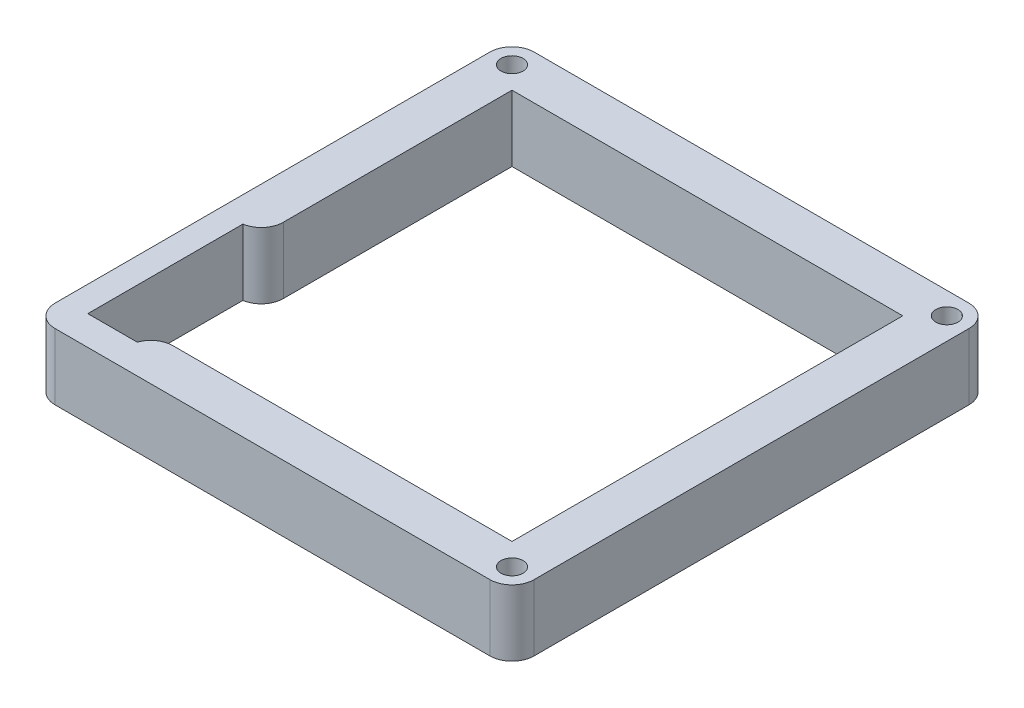
ISO-10303-21;
HEADER;
FILE_DESCRIPTION(('STEP AP214'),'2;1');
FILE_NAME('part.step','',(''),(''),'','','');
FILE_SCHEMA(('AUTOMOTIVE_DESIGN { 1 0 10303 214 1 1 1 1 }'));
ENDSEC;
DATA;
#1=APPLICATION_CONTEXT('core data for automotive mechanical design processes');
#2=APPLICATION_PROTOCOL_DEFINITION('international standard','automotive_design',2000,#1);
#3=PRODUCT_CONTEXT('',#1,'mechanical');
#4=PRODUCT('Part','Part','',(#3));
#5=PRODUCT_RELATED_PRODUCT_CATEGORY('part','',(#4));
#6=PRODUCT_DEFINITION_FORMATION('','',#4);
#7=PRODUCT_DEFINITION_CONTEXT('part definition',#1,'design');
#8=PRODUCT_DEFINITION('design','',#6,#7);
#9=PRODUCT_DEFINITION_SHAPE('','',#8);
#10=(LENGTH_UNIT() NAMED_UNIT(*) SI_UNIT(.MILLI.,.METRE.));
#11=(NAMED_UNIT(*) PLANE_ANGLE_UNIT() SI_UNIT($,.RADIAN.));
#12=(NAMED_UNIT(*) SI_UNIT($,.STERADIAN.) SOLID_ANGLE_UNIT());
#13=UNCERTAINTY_MEASURE_WITH_UNIT(LENGTH_MEASURE(1.E-05),#10,'distance_accuracy_value','');
#14=(GEOMETRIC_REPRESENTATION_CONTEXT(3) GLOBAL_UNCERTAINTY_ASSIGNED_CONTEXT((#13)) GLOBAL_UNIT_ASSIGNED_CONTEXT((#10,
#11,#12)) REPRESENTATION_CONTEXT('',''));
#15=CARTESIAN_POINT('',(0.,0.,0.));
#16=DIRECTION('',(0.,0.,1.));
#17=DIRECTION('',(1.,0.,0.));
#18=AXIS2_PLACEMENT_3D('',#15,#16,#17);
#19=CARTESIAN_POINT('',(0.,19.05,-56.2805835913248));
#20=DIRECTION('',(0.,0.,-1.));
#21=DIRECTION('',(-1.,0.,0.));
#22=AXIS2_PLACEMENT_3D('',#19,#20,#21);
#23=PLANE('',#22);
#24=DIRECTION('',(1.,0.,0.));
#25=VECTOR('',#24,1.);
#26=CARTESIAN_POINT('',(0.,0.,-56.2805835913248));
#27=LINE('',#26,#25);
#28=CARTESIAN_POINT('',(-56.2805835913248,0.,-56.2805835913248));
#29=VERTEX_POINT('',#28);
#30=CARTESIAN_POINT('',(56.2805835913248,0.,-56.2805835913248));
#31=VERTEX_POINT('',#30);
#32=EDGE_CURVE('E171',#29,#31,#27,.T.);
#33=ORIENTED_EDGE('',*,*,#32,.T.);
#34=DIRECTION('',(0.,-1.,0.));
#35=VECTOR('',#34,1.);
#36=CARTESIAN_POINT('',(56.2805835913248,19.05,-56.2805835913248));
#37=LINE('',#36,#35);
#38=CARTESIAN_POINT('',(56.2805835913248,19.05,-56.2805835913248));
#39=VERTEX_POINT('',#38);
#40=EDGE_CURVE('E153',#39,#31,#37,.T.);
#41=ORIENTED_EDGE('',*,*,#40,.F.);
#42=DIRECTION('',(1.,0.,0.));
#43=VECTOR('',#42,1.);
#44=CARTESIAN_POINT('',(0.,19.05,-56.2805835913248));
#45=LINE('',#44,#43);
#46=CARTESIAN_POINT('',(-56.2805835913248,19.05,-56.2805835913248));
#47=VERTEX_POINT('',#46);
#48=EDGE_CURVE('E159',#47,#39,#45,.T.);
#49=ORIENTED_EDGE('',*,*,#48,.F.);
#50=DIRECTION('',(0.,-1.,0.));
#51=VECTOR('',#50,1.);
#52=CARTESIAN_POINT('',(-56.2805835913248,19.05,-56.2805835913248));
#53=LINE('',#52,#51);
#54=EDGE_CURVE('E231',#47,#29,#53,.T.);
#55=ORIENTED_EDGE('',*,*,#54,.T.);
#56=EDGE_LOOP('',(#33,#41,#49,#55));
#57=FACE_BOUND('',#56,.T.);
#58=ADVANCED_FACE('F36',(#57),#23,.F.);
#59=CARTESIAN_POINT('',(56.2805835913248,19.05,0.));
#60=DIRECTION('',(1.,0.,0.));
#61=DIRECTION('',(0.,0.,-1.));
#62=AXIS2_PLACEMENT_3D('',#59,#60,#61);
#63=PLANE('',#62);
#64=DIRECTION('',(0.,0.,1.));
#65=VECTOR('',#64,1.);
#66=CARTESIAN_POINT('',(56.2805835913248,0.,0.));
#67=LINE('',#66,#65);
#68=CARTESIAN_POINT('',(56.2805835913248,0.,56.2805835913248));
#69=VERTEX_POINT('',#68);
#70=EDGE_CURVE('E288',#31,#69,#67,.T.);
#71=ORIENTED_EDGE('',*,*,#70,.T.);
#72=DIRECTION('',(0.,-1.,0.));
#73=VECTOR('',#72,1.);
#74=CARTESIAN_POINT('',(56.2805835913248,19.05,56.2805835913248));
#75=LINE('',#74,#73);
#76=CARTESIAN_POINT('',(56.2805835913248,19.05,56.2805835913248));
#77=VERTEX_POINT('',#76);
#78=EDGE_CURVE('E156',#77,#69,#75,.T.);
#79=ORIENTED_EDGE('',*,*,#78,.F.);
#80=DIRECTION('',(0.,0.,1.));
#81=VECTOR('',#80,1.);
#82=CARTESIAN_POINT('',(56.2805835913248,19.05,0.));
#83=LINE('',#82,#81);
#84=EDGE_CURVE('E148',#39,#77,#83,.T.);
#85=ORIENTED_EDGE('',*,*,#84,.F.);
#86=ORIENTED_EDGE('',*,*,#40,.T.);
#87=EDGE_LOOP('',(#71,#79,#85,#86));
#88=FACE_BOUND('',#87,.T.);
#89=ADVANCED_FACE('F151',(#88),#63,.F.);
#90=CARTESIAN_POINT('',(0.,19.05,56.2805835913248));
#91=DIRECTION('',(0.,0.,-1.));
#92=DIRECTION('',(-1.,0.,0.));
#93=AXIS2_PLACEMENT_3D('',#90,#91,#92);
#94=PLANE('',#93);
#95=DIRECTION('',(1.,0.,0.));
#96=VECTOR('',#95,1.);
#97=CARTESIAN_POINT('',(0.,0.,56.2805835913248));
#98=LINE('',#97,#96);
#99=CARTESIAN_POINT('',(-41.3896001921416,0.,56.2805835913248));
#100=VERTEX_POINT('',#99);
#101=EDGE_CURVE('E248',#100,#69,#98,.T.);
#102=ORIENTED_EDGE('',*,*,#101,.F.);
#103=DIRECTION('',(0.,-1.,0.));
#104=VECTOR('',#103,1.);
#105=CARTESIAN_POINT('',(-41.3896001921416,19.05,56.2805835913248));
#106=LINE('',#105,#104);
#107=CARTESIAN_POINT('',(-41.3896001921416,19.05,56.2805835913248));
#108=VERTEX_POINT('',#107);
#109=EDGE_CURVE('E11',#100,#108,#106,.F.);
#110=ORIENTED_EDGE('',*,*,#109,.T.);
#111=DIRECTION('',(1.,0.,0.));
#112=VECTOR('',#111,1.);
#113=CARTESIAN_POINT('',(0.,19.05,56.2805835913248));
#114=LINE('',#113,#112);
#115=EDGE_CURVE('E158',#108,#77,#114,.T.);
#116=ORIENTED_EDGE('',*,*,#115,.T.);
#117=ORIENTED_EDGE('',*,*,#78,.T.);
#118=EDGE_LOOP('',(#102,#110,#116,#117));
#119=FACE_BOUND('',#118,.T.);
#120=ADVANCED_FACE('F289',(#119),#94,.T.);
#121=CARTESIAN_POINT('',(0.,19.05,60.5459793493046));
#122=DIRECTION('',(0.,0.,-1.));
#123=DIRECTION('',(-1.,0.,0.));
#124=AXIS2_PLACEMENT_3D('',#121,#122,#123);
#125=PLANE('',#124);
#126=DIRECTION('',(1.,0.,0.));
#127=VECTOR('',#126,1.);
#128=CARTESIAN_POINT('',(0.,0.,60.5459793493046));
#129=LINE('',#128,#127);
#130=CARTESIAN_POINT('',(-61.6370769800922,0.,60.5459793493046));
#131=VERTEX_POINT('',#130);
#132=CARTESIAN_POINT('',(-47.3876769800922,0.,60.5459793493046));
#133=VERTEX_POINT('',#132);
#134=EDGE_CURVE('E244',#131,#133,#129,.T.);
#135=ORIENTED_EDGE('',*,*,#134,.F.);
#136=DIRECTION('',(0.,-1.,0.));
#137=VECTOR('',#136,1.);
#138=CARTESIAN_POINT('',(-61.6370769800922,19.05,60.5459793493046));
#139=LINE('',#138,#137);
#140=CARTESIAN_POINT('',(-61.6370769800922,19.05,60.5459793493046));
#141=VERTEX_POINT('',#140);
#142=EDGE_CURVE('E242',#141,#131,#139,.T.);
#143=ORIENTED_EDGE('',*,*,#142,.F.);
#144=DIRECTION('',(1.,0.,0.));
#145=VECTOR('',#144,1.);
#146=CARTESIAN_POINT('',(0.,19.05,60.5459793493046));
#147=LINE('',#146,#145);
#148=CARTESIAN_POINT('',(-47.3876769800922,19.05,60.5459793493046));
#149=VERTEX_POINT('',#148);
#150=EDGE_CURVE('E259',#141,#149,#147,.T.);
#151=ORIENTED_EDGE('',*,*,#150,.T.);
#152=DIRECTION('',(0.,-1.,0.));
#153=VECTOR('',#152,1.);
#154=CARTESIAN_POINT('',(-47.3876769800922,19.05,60.5459793493046));
#155=LINE('',#154,#153);
#156=EDGE_CURVE('E176',#149,#133,#155,.T.);
#157=ORIENTED_EDGE('',*,*,#156,.T.);
#158=EDGE_LOOP('',(#135,#143,#151,#157));
#159=FACE_BOUND('',#158,.T.);
#160=ADVANCED_FACE('F258',(#159),#125,.T.);
#161=CARTESIAN_POINT('',(-61.6370769800922,19.05,0.));
#162=DIRECTION('',(1.,0.,0.));
#163=DIRECTION('',(0.,0.,-1.));
#164=AXIS2_PLACEMENT_3D('',#161,#162,#163);
#165=PLANE('',#164);
#166=DIRECTION('',(0.,0.,1.));
#167=VECTOR('',#166,1.);
#168=CARTESIAN_POINT('',(-61.6370769800922,0.,0.));
#169=LINE('',#168,#167);
#170=CARTESIAN_POINT('',(-61.6370769800922,0.,15.8745968517571));
#171=VERTEX_POINT('',#170);
#172=EDGE_CURVE('E238',#171,#131,#169,.T.);
#173=ORIENTED_EDGE('',*,*,#172,.F.);
#174=DIRECTION('',(0.,-1.,0.));
#175=VECTOR('',#174,1.);
#176=CARTESIAN_POINT('',(-61.6370769800922,19.05,15.8745968517571));
#177=LINE('',#176,#175);
#178=CARTESIAN_POINT('',(-61.6370769800922,19.05,15.8745968517571));
#179=VERTEX_POINT('',#178);
#180=EDGE_CURVE('E234',#179,#171,#177,.T.);
#181=ORIENTED_EDGE('',*,*,#180,.F.);
#182=DIRECTION('',(0.,0.,1.));
#183=VECTOR('',#182,1.);
#184=CARTESIAN_POINT('',(-61.6370769800922,19.05,0.));
#185=LINE('',#184,#183);
#186=EDGE_CURVE('E223',#179,#141,#185,.T.);
#187=ORIENTED_EDGE('',*,*,#186,.T.);
#188=ORIENTED_EDGE('',*,*,#142,.T.);
#189=EDGE_LOOP('',(#173,#181,#187,#188));
#190=FACE_BOUND('',#189,.T.);
#191=ADVANCED_FACE('F241',(#190),#165,.T.);
#192=CARTESIAN_POINT('',(0.,19.05,-68.9805835913248));
#193=DIRECTION('',(0.,0.,1.));
#194=DIRECTION('',(1.,0.,0.));
#195=AXIS2_PLACEMENT_3D('',#192,#193,#194);
#196=PLANE('',#195);
#197=DIRECTION('',(-1.,0.,0.));
#198=VECTOR('',#197,1.);
#199=CARTESIAN_POINT('',(0.,19.05,-68.9805835913248));
#200=LINE('',#199,#198);
#201=CARTESIAN_POINT('',(62.6305835913248,19.05,-68.9805835913248));
#202=VERTEX_POINT('',#201);
#203=CARTESIAN_POINT('',(-62.6305835913248,19.05,-68.9805835913248));
#204=VERTEX_POINT('',#203);
#205=EDGE_CURVE('E505',#202,#204,#200,.T.);
#206=ORIENTED_EDGE('',*,*,#205,.F.);
#207=DIRECTION('',(0.,-1.,0.));
#208=VECTOR('',#207,1.);
#209=CARTESIAN_POINT('',(62.6305835913248,0.,-68.9805835913248));
#210=LINE('',#209,#208);
#211=CARTESIAN_POINT('',(62.6305835913248,0.,-68.9805835913248));
#212=VERTEX_POINT('',#211);
#213=EDGE_CURVE('E174',#202,#212,#210,.T.);
#214=ORIENTED_EDGE('',*,*,#213,.T.);
#215=DIRECTION('',(-1.,0.,0.));
#216=VECTOR('',#215,1.);
#217=CARTESIAN_POINT('',(0.,0.,-68.9805835913248));
#218=LINE('',#217,#216);
#219=CARTESIAN_POINT('',(-62.6305835913248,0.,-68.9805835913248));
#220=VERTEX_POINT('',#219);
#221=EDGE_CURVE('E275',#212,#220,#218,.T.);
#222=ORIENTED_EDGE('',*,*,#221,.T.);
#223=DIRECTION('',(0.,-1.,0.));
#224=VECTOR('',#223,1.);
#225=CARTESIAN_POINT('',(-62.6305835913248,19.05,-68.9805835913248));
#226=LINE('',#225,#224);
#227=EDGE_CURVE('E172',#220,#204,#226,.F.);
#228=ORIENTED_EDGE('',*,*,#227,.T.);
#229=EDGE_LOOP('',(#206,#214,#222,#228));
#230=FACE_BOUND('',#229,.T.);
#231=ADVANCED_FACE('F315',(#230),#196,.F.);
#232=CARTESIAN_POINT('',(-68.9805835913248,19.05,0.));
#233=DIRECTION('',(1.,0.,0.));
#234=DIRECTION('',(0.,0.,-1.));
#235=AXIS2_PLACEMENT_3D('',#232,#233,#234);
#236=PLANE('',#235);
#237=DIRECTION('',(0.,0.,1.));
#238=VECTOR('',#237,1.);
#239=CARTESIAN_POINT('',(-68.9805835913248,0.,0.));
#240=LINE('',#239,#238);
#241=CARTESIAN_POINT('',(-68.9805835913248,0.,-62.6305835913248));
#242=VERTEX_POINT('',#241);
#243=CARTESIAN_POINT('',(-68.9805835913248,0.,62.6305835913248));
#244=VERTEX_POINT('',#243);
#245=EDGE_CURVE('E278',#242,#244,#240,.T.);
#246=ORIENTED_EDGE('',*,*,#245,.T.);
#247=DIRECTION('',(0.,-1.,0.));
#248=VECTOR('',#247,1.);
#249=CARTESIAN_POINT('',(-68.9805835913248,19.05,62.6305835913248));
#250=LINE('',#249,#248);
#251=CARTESIAN_POINT('',(-68.9805835913248,19.05,62.6305835913248));
#252=VERTEX_POINT('',#251);
#253=EDGE_CURVE('E211',#244,#252,#250,.F.);
#254=ORIENTED_EDGE('',*,*,#253,.T.);
#255=DIRECTION('',(0.,0.,1.));
#256=VECTOR('',#255,1.);
#257=CARTESIAN_POINT('',(-68.9805835913248,19.05,0.));
#258=LINE('',#257,#256);
#259=CARTESIAN_POINT('',(-68.9805835913248,19.05,-62.6305835913248));
#260=VERTEX_POINT('',#259);
#261=EDGE_CURVE('E514',#260,#252,#258,.T.);
#262=ORIENTED_EDGE('',*,*,#261,.F.);
#263=DIRECTION('',(0.,-1.,0.));
#264=VECTOR('',#263,1.);
#265=CARTESIAN_POINT('',(-68.9805835913248,19.05,-62.6305835913248));
#266=LINE('',#265,#264);
#267=EDGE_CURVE('E208',#260,#242,#266,.T.);
#268=ORIENTED_EDGE('',*,*,#267,.T.);
#269=EDGE_LOOP('',(#246,#254,#262,#268));
#270=FACE_BOUND('',#269,.T.);
#271=ADVANCED_FACE('F311',(#270),#236,.F.);
#272=CARTESIAN_POINT('',(0.,19.05,68.9805835913248));
#273=DIRECTION('',(0.,0.,1.));
#274=DIRECTION('',(1.,0.,0.));
#275=AXIS2_PLACEMENT_3D('',#272,#273,#274);
#276=PLANE('',#275);
#277=DIRECTION('',(-1.,0.,0.));
#278=VECTOR('',#277,1.);
#279=CARTESIAN_POINT('',(0.,0.,68.9805835913248));
#280=LINE('',#279,#278);
#281=CARTESIAN_POINT('',(62.6305835913248,0.,68.9805835913248));
#282=VERTEX_POINT('',#281);
#283=CARTESIAN_POINT('',(-62.6305835913248,0.,68.9805835913248));
#284=VERTEX_POINT('',#283);
#285=EDGE_CURVE('E281',#282,#284,#280,.T.);
#286=ORIENTED_EDGE('',*,*,#285,.F.);
#287=DIRECTION('',(0.,-1.,0.));
#288=VECTOR('',#287,1.);
#289=CARTESIAN_POINT('',(62.6305835913248,19.05,68.9805835913248));
#290=LINE('',#289,#288);
#291=CARTESIAN_POINT('',(62.6305835913248,19.05,68.9805835913248));
#292=VERTEX_POINT('',#291);
#293=EDGE_CURVE('E206',#282,#292,#290,.F.);
#294=ORIENTED_EDGE('',*,*,#293,.T.);
#295=DIRECTION('',(-1.,0.,0.));
#296=VECTOR('',#295,1.);
#297=CARTESIAN_POINT('',(0.,19.05,68.9805835913248));
#298=LINE('',#297,#296);
#299=CARTESIAN_POINT('',(-62.6305835913248,19.05,68.9805835913248));
#300=VERTEX_POINT('',#299);
#301=EDGE_CURVE('E499',#292,#300,#298,.T.);
#302=ORIENTED_EDGE('',*,*,#301,.T.);
#303=DIRECTION('',(0.,-1.,0.));
#304=VECTOR('',#303,1.);
#305=CARTESIAN_POINT('',(-62.6305835913248,0.,68.9805835913248));
#306=LINE('',#305,#304);
#307=EDGE_CURVE('E203',#300,#284,#306,.T.);
#308=ORIENTED_EDGE('',*,*,#307,.T.);
#309=EDGE_LOOP('',(#286,#294,#302,#308));
#310=FACE_BOUND('',#309,.T.);
#311=ADVANCED_FACE('F307',(#310),#276,.T.);
#312=CARTESIAN_POINT('',(68.9805835913248,19.05,0.));
#313=DIRECTION('',(1.,0.,0.));
#314=DIRECTION('',(0.,0.,-1.));
#315=AXIS2_PLACEMENT_3D('',#312,#313,#314);
#316=PLANE('',#315);
#317=DIRECTION('',(0.,0.,1.));
#318=VECTOR('',#317,1.);
#319=CARTESIAN_POINT('',(68.9805835913248,0.,0.));
#320=LINE('',#319,#318);
#321=CARTESIAN_POINT('',(68.9805835913248,0.,-62.6305835913248));
#322=VERTEX_POINT('',#321);
#323=CARTESIAN_POINT('',(68.9805835913248,0.,62.6305835913248));
#324=VERTEX_POINT('',#323);
#325=EDGE_CURVE('E284',#322,#324,#320,.T.);
#326=ORIENTED_EDGE('',*,*,#325,.F.);
#327=DIRECTION('',(0.,-1.,0.));
#328=VECTOR('',#327,1.);
#329=CARTESIAN_POINT('',(68.9805835913248,19.05,-62.6305835913248));
#330=LINE('',#329,#328);
#331=CARTESIAN_POINT('',(68.9805835913248,19.05,-62.6305835913248));
#332=VERTEX_POINT('',#331);
#333=EDGE_CURVE('E193',#322,#332,#330,.F.);
#334=ORIENTED_EDGE('',*,*,#333,.T.);
#335=DIRECTION('',(0.,0.,1.));
#336=VECTOR('',#335,1.);
#337=CARTESIAN_POINT('',(68.9805835913248,19.05,0.));
#338=LINE('',#337,#336);
#339=CARTESIAN_POINT('',(68.9805835913248,19.05,62.6305835913248));
#340=VERTEX_POINT('',#339);
#341=EDGE_CURVE('E168',#332,#340,#338,.T.);
#342=ORIENTED_EDGE('',*,*,#341,.T.);
#343=DIRECTION('',(0.,-1.,0.));
#344=VECTOR('',#343,1.);
#345=CARTESIAN_POINT('',(68.9805835913248,19.05,62.6305835913248));
#346=LINE('',#345,#344);
#347=EDGE_CURVE('E190',#340,#324,#346,.T.);
#348=ORIENTED_EDGE('',*,*,#347,.T.);
#349=EDGE_LOOP('',(#326,#334,#342,#348));
#350=FACE_BOUND('',#349,.T.);
#351=ADVANCED_FACE('F303',(#350),#316,.T.);
#352=CARTESIAN_POINT('',(62.630583591325,19.05,62.630583591325));
#353=DIRECTION('',(0.,-1.,0.));
#354=DIRECTION('',(0.,0.,-1.));
#355=AXIS2_PLACEMENT_3D('',#352,#353,#354);
#356=CYLINDRICAL_SURFACE('',#355,3.175);
#357=CARTESIAN_POINT('',(62.630583591325,19.05,62.630583591325));
#358=DIRECTION('',(0.,1.,0.));
#359=DIRECTION('',(0.,0.,1.));
#360=AXIS2_PLACEMENT_3D('',#357,#358,#359);
#361=CIRCLE('',#360,3.175);
#362=CARTESIAN_POINT('',(62.630583591325,19.05,59.455583591325));
#363=VERTEX_POINT('',#362);
#364=EDGE_CURVE('E490',#363,#363,#361,.T.);
#365=CARTESIAN_POINT('',(62.630583591325,0.,62.630583591325));
#366=DIRECTION('',(0.,1.,0.));
#367=DIRECTION('',(0.,0.,1.));
#368=AXIS2_PLACEMENT_3D('',#365,#366,#367);
#369=CIRCLE('',#368,3.175);
#370=CARTESIAN_POINT('',(62.630583591325,0.,59.455583591325));
#371=VERTEX_POINT('',#370);
#372=EDGE_CURVE('E272',#371,#371,#369,.T.);
#373=CARTESIAN_POINT('',(62.630583591325,19.05,59.455583591325));
#374=CARTESIAN_POINT('',(62.630583591325,18.8515625,59.455583591325));
#375=CARTESIAN_POINT('',(62.630583591325,18.653125,59.455583591325));
#376=CARTESIAN_POINT('',(62.630583591325,18.25625,59.455583591325));
#377=CARTESIAN_POINT('',(62.630583591325,18.0578125,59.455583591325));
#378=CARTESIAN_POINT('',(62.630583591325,17.6609375,59.455583591325));
#379=CARTESIAN_POINT('',(62.630583591325,17.4625,59.455583591325));
#380=CARTESIAN_POINT('',(62.630583591325,17.065625,59.455583591325));
#381=CARTESIAN_POINT('',(62.630583591325,16.8671875,59.455583591325));
#382=CARTESIAN_POINT('',(62.630583591325,16.4703125,59.455583591325));
#383=CARTESIAN_POINT('',(62.630583591325,16.271875,59.455583591325));
#384=CARTESIAN_POINT('',(62.630583591325,15.875,59.455583591325));
#385=CARTESIAN_POINT('',(62.630583591325,15.6765625,59.455583591325));
#386=CARTESIAN_POINT('',(62.630583591325,15.2796875,59.455583591325));
#387=CARTESIAN_POINT('',(62.630583591325,15.08125,59.455583591325));
#388=CARTESIAN_POINT('',(62.630583591325,14.684375,59.455583591325));
#389=CARTESIAN_POINT('',(62.630583591325,14.4859375,59.455583591325));
#390=CARTESIAN_POINT('',(62.630583591325,14.0890625,59.455583591325));
#391=CARTESIAN_POINT('',(62.630583591325,13.890625,59.455583591325));
#392=CARTESIAN_POINT('',(62.630583591325,13.49375,59.455583591325));
#393=CARTESIAN_POINT('',(62.630583591325,13.2953125,59.455583591325));
#394=CARTESIAN_POINT('',(62.630583591325,12.8984375,59.455583591325));
#395=CARTESIAN_POINT('',(62.630583591325,12.7,59.455583591325));
#396=CARTESIAN_POINT('',(62.630583591325,12.303125,59.455583591325));
#397=CARTESIAN_POINT('',(62.630583591325,12.1046875,59.455583591325));
#398=CARTESIAN_POINT('',(62.630583591325,11.7078125,59.455583591325));
#399=CARTESIAN_POINT('',(62.630583591325,11.509375,59.455583591325));
#400=CARTESIAN_POINT('',(62.630583591325,11.1125,59.455583591325));
#401=CARTESIAN_POINT('',(62.630583591325,10.9140625,59.455583591325));
#402=CARTESIAN_POINT('',(62.630583591325,10.5171875,59.455583591325));
#403=CARTESIAN_POINT('',(62.630583591325,10.31875,59.455583591325));
#404=CARTESIAN_POINT('',(62.630583591325,9.921875,59.455583591325));
#405=CARTESIAN_POINT('',(62.630583591325,9.7234375,59.455583591325));
#406=CARTESIAN_POINT('',(62.630583591325,9.3265625,59.455583591325));
#407=CARTESIAN_POINT('',(62.630583591325,9.128125,59.455583591325));
#408=CARTESIAN_POINT('',(62.630583591325,8.73125,59.455583591325));
#409=CARTESIAN_POINT('',(62.630583591325,8.5328125,59.455583591325));
#410=CARTESIAN_POINT('',(62.630583591325,8.1359375,59.455583591325));
#411=CARTESIAN_POINT('',(62.630583591325,7.9375,59.455583591325));
#412=CARTESIAN_POINT('',(62.630583591325,7.540625,59.455583591325));
#413=CARTESIAN_POINT('',(62.630583591325,7.3421875,59.455583591325));
#414=CARTESIAN_POINT('',(62.630583591325,6.9453125,59.455583591325));
#415=CARTESIAN_POINT('',(62.630583591325,6.746875,59.455583591325));
#416=CARTESIAN_POINT('',(62.630583591325,6.35,59.455583591325));
#417=CARTESIAN_POINT('',(62.630583591325,6.1515625,59.455583591325));
#418=CARTESIAN_POINT('',(62.630583591325,5.7546875,59.455583591325));
#419=CARTESIAN_POINT('',(62.630583591325,5.55625,59.455583591325));
#420=CARTESIAN_POINT('',(62.630583591325,5.159375,59.455583591325));
#421=CARTESIAN_POINT('',(62.630583591325,4.9609375,59.455583591325));
#422=CARTESIAN_POINT('',(62.630583591325,4.5640625,59.455583591325));
#423=CARTESIAN_POINT('',(62.630583591325,4.365625,59.455583591325));
#424=CARTESIAN_POINT('',(62.630583591325,3.96875,59.455583591325));
#425=CARTESIAN_POINT('',(62.630583591325,3.7703125,59.455583591325));
#426=CARTESIAN_POINT('',(62.630583591325,3.3734375,59.455583591325));
#427=CARTESIAN_POINT('',(62.630583591325,3.175,59.455583591325));
#428=CARTESIAN_POINT('',(62.630583591325,2.778125,59.455583591325));
#429=CARTESIAN_POINT('',(62.630583591325,2.5796875,59.455583591325));
#430=CARTESIAN_POINT('',(62.630583591325,2.1828125,59.455583591325));
#431=CARTESIAN_POINT('',(62.630583591325,1.984375,59.455583591325));
#432=CARTESIAN_POINT('',(62.630583591325,1.5875,59.455583591325));
#433=CARTESIAN_POINT('',(62.630583591325,1.3890625,59.455583591325));
#434=CARTESIAN_POINT('',(62.630583591325,0.992187500000001,59.455583591325));
#435=CARTESIAN_POINT('',(62.630583591325,0.793750000000001,59.455583591325));
#436=CARTESIAN_POINT('',(62.630583591325,0.396875,59.455583591325));
#437=CARTESIAN_POINT('',(62.630583591325,0.1984375,59.455583591325));
#438=CARTESIAN_POINT('',(62.630583591325,0.,59.455583591325));
#439=B_SPLINE_CURVE_WITH_KNOTS('',3,(#373,#374,#375,#376,#377,#378,#379,#380,#381,#382,#383,
#384,#385,#386,#387,#388,#389,#390,#391,#392,#393,#394,#395,#396,#397,#398,#399,#400,#401,#402,
#403,#404,#405,#406,#407,#408,#409,#410,#411,#412,#413,#414,#415,#416,#417,#418,#419,#420,#421,
#422,#423,#424,#425,#426,#427,#428,#429,#430,#431,#432,#433,#434,#435,#436,#437,#438),
.UNSPECIFIED.,.F.,.F.,(4,2,2,2,2,2,2,2,2,2,2,2,2,2,2,2,2,2,2,2,2,2,2,2,2,2,2,2,2,2,2,2,4),(0.,
0.595312499999997,1.190625,1.7859375,2.38125,2.9765625,3.571875,4.1671875,4.7625,5.3578125,
5.953125,6.5484375,7.14375,7.7390625,8.334375,8.9296875,9.525,10.1203125,10.715625,11.3109375,
11.90625,12.5015625,13.096875,13.6921875,14.2875,14.8828125,15.478125,16.0734375,16.66875,
17.2640625,17.859375,18.4546875,19.05),.UNSPECIFIED.);
#440=EDGE_CURVE('BSEAM306',#363,#371,#439,.T.);
#441=ORIENTED_EDGE('',*,*,#364,.T.);
#442=ORIENTED_EDGE('',*,*,#372,.F.);
#443=ORIENTED_EDGE('',*,*,#440,.T.);
#444=ORIENTED_EDGE('',*,*,#440,.F.);
#445=EDGE_LOOP('',(#441,#443,#442,#444));
#446=FACE_BOUND('',#445,.T.);
#447=ADVANCED_FACE('F306',(#446),#356,.F.);
#448=CARTESIAN_POINT('',(62.630583591325,19.05,-62.6305835913249));
#449=DIRECTION('',(0.,-1.,0.));
#450=DIRECTION('',(0.,0.,-1.));
#451=AXIS2_PLACEMENT_3D('',#448,#449,#450);
#452=CYLINDRICAL_SURFACE('',#451,3.175);
#453=CARTESIAN_POINT('',(62.630583591325,19.05,-62.6305835913249));
#454=DIRECTION('',(0.,1.,0.));
#455=DIRECTION('',(0.,0.,1.));
#456=AXIS2_PLACEMENT_3D('',#453,#454,#455);
#457=CIRCLE('',#456,3.175);
#458=CARTESIAN_POINT('',(62.630583591325,19.05,-65.8055835913249));
#459=VERTEX_POINT('',#458);
#460=EDGE_CURVE('E486',#459,#459,#457,.T.);
#461=CARTESIAN_POINT('',(62.630583591325,0.,-62.6305835913249));
#462=DIRECTION('',(0.,1.,0.));
#463=DIRECTION('',(0.,0.,1.));
#464=AXIS2_PLACEMENT_3D('',#461,#462,#463);
#465=CIRCLE('',#464,3.175);
#466=CARTESIAN_POINT('',(62.630583591325,0.,-65.8055835913249));
#467=VERTEX_POINT('',#466);
#468=EDGE_CURVE('E269',#467,#467,#465,.T.);
#469=CARTESIAN_POINT('',(62.630583591325,19.05,-65.8055835913249));
#470=CARTESIAN_POINT('',(62.630583591325,18.8515625,-65.8055835913249));
#471=CARTESIAN_POINT('',(62.630583591325,18.653125,-65.8055835913249));
#472=CARTESIAN_POINT('',(62.630583591325,18.25625,-65.8055835913249));
#473=CARTESIAN_POINT('',(62.630583591325,18.0578125,-65.8055835913249));
#474=CARTESIAN_POINT('',(62.630583591325,17.6609375,-65.8055835913249));
#475=CARTESIAN_POINT('',(62.630583591325,17.4625,-65.8055835913249));
#476=CARTESIAN_POINT('',(62.630583591325,17.065625,-65.8055835913249));
#477=CARTESIAN_POINT('',(62.630583591325,16.8671875,-65.8055835913249));
#478=CARTESIAN_POINT('',(62.630583591325,16.4703125,-65.8055835913249));
#479=CARTESIAN_POINT('',(62.630583591325,16.271875,-65.8055835913249));
#480=CARTESIAN_POINT('',(62.630583591325,15.875,-65.8055835913249));
#481=CARTESIAN_POINT('',(62.630583591325,15.6765625,-65.8055835913249));
#482=CARTESIAN_POINT('',(62.630583591325,15.2796875,-65.8055835913249));
#483=CARTESIAN_POINT('',(62.630583591325,15.08125,-65.8055835913249));
#484=CARTESIAN_POINT('',(62.630583591325,14.684375,-65.8055835913249));
#485=CARTESIAN_POINT('',(62.630583591325,14.4859375,-65.8055835913249));
#486=CARTESIAN_POINT('',(62.630583591325,14.0890625,-65.8055835913249));
#487=CARTESIAN_POINT('',(62.630583591325,13.890625,-65.8055835913249));
#488=CARTESIAN_POINT('',(62.630583591325,13.49375,-65.8055835913249));
#489=CARTESIAN_POINT('',(62.630583591325,13.2953125,-65.8055835913249));
#490=CARTESIAN_POINT('',(62.630583591325,12.8984375,-65.8055835913249));
#491=CARTESIAN_POINT('',(62.630583591325,12.7,-65.8055835913249));
#492=CARTESIAN_POINT('',(62.630583591325,12.303125,-65.8055835913249));
#493=CARTESIAN_POINT('',(62.630583591325,12.1046875,-65.8055835913249));
#494=CARTESIAN_POINT('',(62.630583591325,11.7078125,-65.8055835913249));
#495=CARTESIAN_POINT('',(62.630583591325,11.509375,-65.8055835913249));
#496=CARTESIAN_POINT('',(62.630583591325,11.1125,-65.8055835913249));
#497=CARTESIAN_POINT('',(62.630583591325,10.9140625,-65.8055835913249));
#498=CARTESIAN_POINT('',(62.630583591325,10.5171875,-65.8055835913249));
#499=CARTESIAN_POINT('',(62.630583591325,10.31875,-65.8055835913249));
#500=CARTESIAN_POINT('',(62.630583591325,9.921875,-65.8055835913249));
#501=CARTESIAN_POINT('',(62.630583591325,9.7234375,-65.8055835913249));
#502=CARTESIAN_POINT('',(62.630583591325,9.3265625,-65.8055835913249));
#503=CARTESIAN_POINT('',(62.630583591325,9.128125,-65.8055835913249));
#504=CARTESIAN_POINT('',(62.630583591325,8.73125,-65.8055835913249));
#505=CARTESIAN_POINT('',(62.630583591325,8.5328125,-65.8055835913249));
#506=CARTESIAN_POINT('',(62.630583591325,8.1359375,-65.8055835913249));
#507=CARTESIAN_POINT('',(62.630583591325,7.9375,-65.8055835913249));
#508=CARTESIAN_POINT('',(62.630583591325,7.540625,-65.8055835913249));
#509=CARTESIAN_POINT('',(62.630583591325,7.3421875,-65.8055835913249));
#510=CARTESIAN_POINT('',(62.630583591325,6.9453125,-65.8055835913249));
#511=CARTESIAN_POINT('',(62.630583591325,6.746875,-65.8055835913249));
#512=CARTESIAN_POINT('',(62.630583591325,6.35,-65.8055835913249));
#513=CARTESIAN_POINT('',(62.630583591325,6.1515625,-65.8055835913249));
#514=CARTESIAN_POINT('',(62.630583591325,5.7546875,-65.8055835913249));
#515=CARTESIAN_POINT('',(62.630583591325,5.55625,-65.8055835913249));
#516=CARTESIAN_POINT('',(62.630583591325,5.159375,-65.8055835913249));
#517=CARTESIAN_POINT('',(62.630583591325,4.9609375,-65.8055835913249));
#518=CARTESIAN_POINT('',(62.630583591325,4.5640625,-65.8055835913249));
#519=CARTESIAN_POINT('',(62.630583591325,4.365625,-65.8055835913249));
#520=CARTESIAN_POINT('',(62.630583591325,3.96875,-65.8055835913249));
#521=CARTESIAN_POINT('',(62.630583591325,3.7703125,-65.8055835913249));
#522=CARTESIAN_POINT('',(62.630583591325,3.3734375,-65.8055835913249));
#523=CARTESIAN_POINT('',(62.630583591325,3.175,-65.8055835913249));
#524=CARTESIAN_POINT('',(62.630583591325,2.778125,-65.8055835913249));
#525=CARTESIAN_POINT('',(62.630583591325,2.5796875,-65.8055835913249));
#526=CARTESIAN_POINT('',(62.630583591325,2.1828125,-65.8055835913249));
#527=CARTESIAN_POINT('',(62.630583591325,1.984375,-65.8055835913249));
#528=CARTESIAN_POINT('',(62.630583591325,1.5875,-65.8055835913249));
#529=CARTESIAN_POINT('',(62.630583591325,1.3890625,-65.8055835913249));
#530=CARTESIAN_POINT('',(62.630583591325,0.992187500000001,-65.8055835913249));
#531=CARTESIAN_POINT('',(62.630583591325,0.793750000000001,-65.8055835913249));
#532=CARTESIAN_POINT('',(62.630583591325,0.396875,-65.8055835913249));
#533=CARTESIAN_POINT('',(62.630583591325,0.1984375,-65.8055835913249));
#534=CARTESIAN_POINT('',(62.630583591325,0.,-65.8055835913249));
#535=B_SPLINE_CURVE_WITH_KNOTS('',3,(#469,#470,#471,#472,#473,#474,#475,#476,#477,#478,#479,
#480,#481,#482,#483,#484,#485,#486,#487,#488,#489,#490,#491,#492,#493,#494,#495,#496,#497,#498,
#499,#500,#501,#502,#503,#504,#505,#506,#507,#508,#509,#510,#511,#512,#513,#514,#515,#516,#517,
#518,#519,#520,#521,#522,#523,#524,#525,#526,#527,#528,#529,#530,#531,#532,#533,#534),
.UNSPECIFIED.,.F.,.F.,(4,2,2,2,2,2,2,2,2,2,2,2,2,2,2,2,2,2,2,2,2,2,2,2,2,2,2,2,2,2,2,2,4),(0.,
0.595312499999997,1.190625,1.7859375,2.38125,2.9765625,3.571875,4.1671875,4.7625,5.3578125,
5.953125,6.5484375,7.14375,7.7390625,8.334375,8.9296875,9.525,10.1203125,10.715625,11.3109375,
11.90625,12.5015625,13.096875,13.6921875,14.2875,14.8828125,15.478125,16.0734375,16.66875,
17.2640625,17.859375,18.4546875,19.05),.UNSPECIFIED.);
#536=EDGE_CURVE('BSEAM322',#459,#467,#535,.T.);
#537=ORIENTED_EDGE('',*,*,#460,.T.);
#538=ORIENTED_EDGE('',*,*,#468,.F.);
#539=ORIENTED_EDGE('',*,*,#536,.T.);
#540=ORIENTED_EDGE('',*,*,#536,.F.);
#541=EDGE_LOOP('',(#537,#539,#538,#540));
#542=FACE_BOUND('',#541,.T.);
#543=ADVANCED_FACE('F322',(#542),#452,.F.);
#544=CARTESIAN_POINT('',(-62.630583591325,19.05,-62.6305835913249));
#545=DIRECTION('',(0.,-1.,0.));
#546=DIRECTION('',(0.,0.,-1.));
#547=AXIS2_PLACEMENT_3D('',#544,#545,#546);
#548=CYLINDRICAL_SURFACE('',#547,3.175);
#549=CARTESIAN_POINT('',(-62.630583591325,19.05,-62.6305835913249));
#550=DIRECTION('',(0.,1.,0.));
#551=DIRECTION('',(0.,0.,1.));
#552=AXIS2_PLACEMENT_3D('',#549,#550,#551);
#553=CIRCLE('',#552,3.175);
#554=CARTESIAN_POINT('',(-62.630583591325,19.05,-65.8055835913249));
#555=VERTEX_POINT('',#554);
#556=EDGE_CURVE('E246',#555,#555,#553,.T.);
#557=CARTESIAN_POINT('',(-62.630583591325,0.,-62.6305835913249));
#558=DIRECTION('',(0.,1.,0.));
#559=DIRECTION('',(0.,0.,1.));
#560=AXIS2_PLACEMENT_3D('',#557,#558,#559);
#561=CIRCLE('',#560,3.175);
#562=CARTESIAN_POINT('',(-62.630583591325,0.,-65.8055835913249));
#563=VERTEX_POINT('',#562);
#564=EDGE_CURVE('E266',#563,#563,#561,.T.);
#565=CARTESIAN_POINT('',(-62.630583591325,19.05,-65.8055835913249));
#566=CARTESIAN_POINT('',(-62.630583591325,18.8515625,-65.8055835913249));
#567=CARTESIAN_POINT('',(-62.630583591325,18.653125,-65.8055835913249));
#568=CARTESIAN_POINT('',(-62.630583591325,18.25625,-65.8055835913249));
#569=CARTESIAN_POINT('',(-62.630583591325,18.0578125,-65.8055835913249));
#570=CARTESIAN_POINT('',(-62.630583591325,17.6609375,-65.8055835913249));
#571=CARTESIAN_POINT('',(-62.630583591325,17.4625,-65.8055835913249));
#572=CARTESIAN_POINT('',(-62.630583591325,17.065625,-65.8055835913249));
#573=CARTESIAN_POINT('',(-62.630583591325,16.8671875,-65.8055835913249));
#574=CARTESIAN_POINT('',(-62.630583591325,16.4703125,-65.8055835913249));
#575=CARTESIAN_POINT('',(-62.630583591325,16.271875,-65.8055835913249));
#576=CARTESIAN_POINT('',(-62.630583591325,15.875,-65.8055835913249));
#577=CARTESIAN_POINT('',(-62.630583591325,15.6765625,-65.8055835913249));
#578=CARTESIAN_POINT('',(-62.630583591325,15.2796875,-65.8055835913249));
#579=CARTESIAN_POINT('',(-62.630583591325,15.08125,-65.8055835913249));
#580=CARTESIAN_POINT('',(-62.630583591325,14.684375,-65.8055835913249));
#581=CARTESIAN_POINT('',(-62.630583591325,14.4859375,-65.8055835913249));
#582=CARTESIAN_POINT('',(-62.630583591325,14.0890625,-65.8055835913249));
#583=CARTESIAN_POINT('',(-62.630583591325,13.890625,-65.8055835913249));
#584=CARTESIAN_POINT('',(-62.630583591325,13.49375,-65.8055835913249));
#585=CARTESIAN_POINT('',(-62.630583591325,13.2953125,-65.8055835913249));
#586=CARTESIAN_POINT('',(-62.630583591325,12.8984375,-65.8055835913249));
#587=CARTESIAN_POINT('',(-62.630583591325,12.7,-65.8055835913249));
#588=CARTESIAN_POINT('',(-62.630583591325,12.303125,-65.8055835913249));
#589=CARTESIAN_POINT('',(-62.630583591325,12.1046875,-65.8055835913249));
#590=CARTESIAN_POINT('',(-62.630583591325,11.7078125,-65.8055835913249));
#591=CARTESIAN_POINT('',(-62.630583591325,11.509375,-65.8055835913249));
#592=CARTESIAN_POINT('',(-62.630583591325,11.1125,-65.8055835913249));
#593=CARTESIAN_POINT('',(-62.630583591325,10.9140625,-65.8055835913249));
#594=CARTESIAN_POINT('',(-62.630583591325,10.5171875,-65.8055835913249));
#595=CARTESIAN_POINT('',(-62.630583591325,10.31875,-65.8055835913249));
#596=CARTESIAN_POINT('',(-62.630583591325,9.921875,-65.8055835913249));
#597=CARTESIAN_POINT('',(-62.630583591325,9.7234375,-65.8055835913249));
#598=CARTESIAN_POINT('',(-62.630583591325,9.3265625,-65.8055835913249));
#599=CARTESIAN_POINT('',(-62.630583591325,9.128125,-65.8055835913249));
#600=CARTESIAN_POINT('',(-62.630583591325,8.73125,-65.8055835913249));
#601=CARTESIAN_POINT('',(-62.630583591325,8.5328125,-65.8055835913249));
#602=CARTESIAN_POINT('',(-62.630583591325,8.1359375,-65.8055835913249));
#603=CARTESIAN_POINT('',(-62.630583591325,7.9375,-65.8055835913249));
#604=CARTESIAN_POINT('',(-62.630583591325,7.540625,-65.8055835913249));
#605=CARTESIAN_POINT('',(-62.630583591325,7.3421875,-65.8055835913249));
#606=CARTESIAN_POINT('',(-62.630583591325,6.9453125,-65.8055835913249));
#607=CARTESIAN_POINT('',(-62.630583591325,6.746875,-65.8055835913249));
#608=CARTESIAN_POINT('',(-62.630583591325,6.35,-65.8055835913249));
#609=CARTESIAN_POINT('',(-62.630583591325,6.1515625,-65.8055835913249));
#610=CARTESIAN_POINT('',(-62.630583591325,5.7546875,-65.8055835913249));
#611=CARTESIAN_POINT('',(-62.630583591325,5.55625,-65.8055835913249));
#612=CARTESIAN_POINT('',(-62.630583591325,5.159375,-65.8055835913249));
#613=CARTESIAN_POINT('',(-62.630583591325,4.9609375,-65.8055835913249));
#614=CARTESIAN_POINT('',(-62.630583591325,4.5640625,-65.8055835913249));
#615=CARTESIAN_POINT('',(-62.630583591325,4.365625,-65.8055835913249));
#616=CARTESIAN_POINT('',(-62.630583591325,3.96875,-65.8055835913249));
#617=CARTESIAN_POINT('',(-62.630583591325,3.7703125,-65.8055835913249));
#618=CARTESIAN_POINT('',(-62.630583591325,3.3734375,-65.8055835913249));
#619=CARTESIAN_POINT('',(-62.630583591325,3.175,-65.8055835913249));
#620=CARTESIAN_POINT('',(-62.630583591325,2.778125,-65.8055835913249));
#621=CARTESIAN_POINT('',(-62.630583591325,2.5796875,-65.8055835913249));
#622=CARTESIAN_POINT('',(-62.630583591325,2.1828125,-65.8055835913249));
#623=CARTESIAN_POINT('',(-62.630583591325,1.984375,-65.8055835913249));
#624=CARTESIAN_POINT('',(-62.630583591325,1.5875,-65.8055835913249));
#625=CARTESIAN_POINT('',(-62.630583591325,1.3890625,-65.8055835913249));
#626=CARTESIAN_POINT('',(-62.630583591325,0.992187500000001,-65.8055835913249));
#627=CARTESIAN_POINT('',(-62.630583591325,0.793750000000001,-65.8055835913249));
#628=CARTESIAN_POINT('',(-62.630583591325,0.396875,-65.8055835913249));
#629=CARTESIAN_POINT('',(-62.630583591325,0.1984375,-65.8055835913249));
#630=CARTESIAN_POINT('',(-62.630583591325,0.,-65.8055835913249));
#631=B_SPLINE_CURVE_WITH_KNOTS('',3,(#565,#566,#567,#568,#569,#570,#571,#572,#573,#574,#575,
#576,#577,#578,#579,#580,#581,#582,#583,#584,#585,#586,#587,#588,#589,#590,#591,#592,#593,#594,
#595,#596,#597,#598,#599,#600,#601,#602,#603,#604,#605,#606,#607,#608,#609,#610,#611,#612,#613,
#614,#615,#616,#617,#618,#619,#620,#621,#622,#623,#624,#625,#626,#627,#628,#629,#630),
.UNSPECIFIED.,.F.,.F.,(4,2,2,2,2,2,2,2,2,2,2,2,2,2,2,2,2,2,2,2,2,2,2,2,2,2,2,2,2,2,2,2,4),(0.,
0.595312499999997,1.190625,1.7859375,2.38125,2.9765625,3.571875,4.1671875,4.7625,5.3578125,
5.953125,6.5484375,7.14375,7.7390625,8.334375,8.9296875,9.525,10.1203125,10.715625,11.3109375,
11.90625,12.5015625,13.096875,13.6921875,14.2875,14.8828125,15.478125,16.0734375,16.66875,
17.2640625,17.859375,18.4546875,19.05),.UNSPECIFIED.);
#632=EDGE_CURVE('BSEAM326',#555,#563,#631,.T.);
#633=ORIENTED_EDGE('',*,*,#556,.T.);
#634=ORIENTED_EDGE('',*,*,#564,.F.);
#635=ORIENTED_EDGE('',*,*,#632,.T.);
#636=ORIENTED_EDGE('',*,*,#632,.F.);
#637=EDGE_LOOP('',(#633,#635,#634,#636));
#638=FACE_BOUND('',#637,.T.);
#639=ADVANCED_FACE('F326',(#638),#548,.F.);
#640=CARTESIAN_POINT('',(-56.2805835913248,19.05,0.));
#641=DIRECTION('',(1.,0.,0.));
#642=DIRECTION('',(0.,0.,-1.));
#643=AXIS2_PLACEMENT_3D('',#640,#641,#642);
#644=PLANE('',#643);
#645=DIRECTION('',(0.,0.,1.));
#646=VECTOR('',#645,1.);
#647=CARTESIAN_POINT('',(-56.2805835913248,19.05,0.));
#648=LINE('',#647,#646);
#649=CARTESIAN_POINT('',(-56.2805835913248,19.05,9.60279929336628));
#650=VERTEX_POINT('',#649);
#651=EDGE_CURVE('E166',#47,#650,#648,.T.);
#652=ORIENTED_EDGE('',*,*,#651,.T.);
#653=DIRECTION('',(0.,1.,0.));
#654=VECTOR('',#653,1.);
#655=CARTESIAN_POINT('',(-56.2805835913248,0.,9.60279929336628));
#656=LINE('',#655,#654);
#657=CARTESIAN_POINT('',(-56.2805835913248,0.,9.60279929336628));
#658=VERTEX_POINT('',#657);
#659=EDGE_CURVE('E213',#650,#658,#656,.F.);
#660=ORIENTED_EDGE('',*,*,#659,.T.);
#661=DIRECTION('',(0.,0.,1.));
#662=VECTOR('',#661,1.);
#663=CARTESIAN_POINT('',(-56.2805835913248,0.,0.));
#664=LINE('',#663,#662);
#665=EDGE_CURVE('E239',#29,#658,#664,.T.);
#666=ORIENTED_EDGE('',*,*,#665,.F.);
#667=ORIENTED_EDGE('',*,*,#54,.F.);
#668=EDGE_LOOP('',(#652,#660,#666,#667));
#669=FACE_BOUND('',#668,.T.);
#670=ADVANCED_FACE('F228',(#669),#644,.T.);
#671=CARTESIAN_POINT('',(0.,19.05,0.));
#672=DIRECTION('',(0.,1.,0.));
#673=DIRECTION('',(0.,0.,1.));
#674=AXIS2_PLACEMENT_3D('',#671,#672,#673);
#675=PLANE('',#674);
#676=ORIENTED_EDGE('',*,*,#556,.F.);
#677=EDGE_LOOP('',(#676));
#678=FACE_BOUND('',#677,.T.);
#679=ORIENTED_EDGE('',*,*,#460,.F.);
#680=EDGE_LOOP('',(#679));
#681=FACE_BOUND('',#680,.T.);
#682=ORIENTED_EDGE('',*,*,#364,.F.);
#683=EDGE_LOOP('',(#682));
#684=FACE_BOUND('',#683,.T.);
#685=ORIENTED_EDGE('',*,*,#341,.F.);
#686=CARTESIAN_POINT('',(62.6305835913248,19.05,-62.6305835913248));
#687=DIRECTION('',(0.,1.,0.));
#688=DIRECTION('',(0.,0.,1.));
#689=AXIS2_PLACEMENT_3D('',#686,#687,#688);
#690=CIRCLE('',#689,6.35);
#691=EDGE_CURVE('E201',#332,#202,#690,.T.);
#692=ORIENTED_EDGE('',*,*,#691,.T.);
#693=ORIENTED_EDGE('',*,*,#205,.T.);
#694=CARTESIAN_POINT('',(-62.6305835913248,19.05,-62.6305835913248));
#695=DIRECTION('',(0.,1.,0.));
#696=DIRECTION('',(0.,0.,1.));
#697=AXIS2_PLACEMENT_3D('',#694,#695,#696);
#698=CIRCLE('',#697,6.35);
#699=EDGE_CURVE('E195',#204,#260,#698,.T.);
#700=ORIENTED_EDGE('',*,*,#699,.T.);
#701=ORIENTED_EDGE('',*,*,#261,.T.);
#702=CARTESIAN_POINT('',(-62.6305835913248,19.05,62.6305835913248));
#703=DIRECTION('',(0.,1.,0.));
#704=DIRECTION('',(0.,0.,1.));
#705=AXIS2_PLACEMENT_3D('',#702,#703,#704);
#706=CIRCLE('',#705,6.35);
#707=EDGE_CURVE('E197',#252,#300,#706,.T.);
#708=ORIENTED_EDGE('',*,*,#707,.T.);
#709=ORIENTED_EDGE('',*,*,#301,.F.);
#710=CARTESIAN_POINT('',(62.6305835913248,19.05,62.6305835913248));
#711=DIRECTION('',(0.,1.,0.));
#712=DIRECTION('',(0.,0.,1.));
#713=AXIS2_PLACEMENT_3D('',#710,#711,#712);
#714=CIRCLE('',#713,6.35);
#715=EDGE_CURVE('E199',#292,#340,#714,.T.);
#716=ORIENTED_EDGE('',*,*,#715,.T.);
#717=EDGE_LOOP('',(#685,#692,#693,#700,#701,#708,#709,#716));
#718=FACE_BOUND('',#717,.T.);
#719=ORIENTED_EDGE('',*,*,#186,.F.);
#720=CARTESIAN_POINT('',(-62.6305835913248,19.05,9.60279929336628));
#721=DIRECTION('',(0.,1.,0.));
#722=DIRECTION('',(0.,0.,1.));
#723=AXIS2_PLACEMENT_3D('',#720,#721,#722);
#724=CIRCLE('',#723,6.35);
#725=EDGE_CURVE('E44',#179,#650,#724,.T.);
#726=ORIENTED_EDGE('',*,*,#725,.T.);
#727=ORIENTED_EDGE('',*,*,#651,.F.);
#728=ORIENTED_EDGE('',*,*,#48,.T.);
#729=ORIENTED_EDGE('',*,*,#84,.T.);
#730=ORIENTED_EDGE('',*,*,#115,.F.);
#731=CARTESIAN_POINT('',(-41.3896001921416,19.05,62.6305835913248));
#732=DIRECTION('',(0.,1.,0.));
#733=DIRECTION('',(0.,0.,1.));
#734=AXIS2_PLACEMENT_3D('',#731,#732,#733);
#735=CIRCLE('',#734,6.35);
#736=EDGE_CURVE('E219',#108,#149,#735,.T.);
#737=ORIENTED_EDGE('',*,*,#736,.T.);
#738=ORIENTED_EDGE('',*,*,#150,.F.);
#739=EDGE_LOOP('',(#719,#726,#727,#728,#729,#730,#737,#738));
#740=FACE_BOUND('',#739,.T.);
#741=ADVANCED_FACE('F164',(#678,#681,#684,#718,#740),#675,.T.);
#742=CARTESIAN_POINT('',(0.,0.,0.));
#743=DIRECTION('',(0.,1.,0.));
#744=DIRECTION('',(0.,0.,1.));
#745=AXIS2_PLACEMENT_3D('',#742,#743,#744);
#746=PLANE('',#745);
#747=ORIENTED_EDGE('',*,*,#564,.T.);
#748=EDGE_LOOP('',(#747));
#749=FACE_BOUND('',#748,.T.);
#750=ORIENTED_EDGE('',*,*,#468,.T.);
#751=EDGE_LOOP('',(#750));
#752=FACE_BOUND('',#751,.T.);
#753=ORIENTED_EDGE('',*,*,#372,.T.);
#754=EDGE_LOOP('',(#753));
#755=FACE_BOUND('',#754,.T.);
#756=ORIENTED_EDGE('',*,*,#221,.F.);
#757=CARTESIAN_POINT('',(62.6305835913248,0.,-62.6305835913248));
#758=DIRECTION('',(0.,1.,0.));
#759=DIRECTION('',(0.,0.,1.));
#760=AXIS2_PLACEMENT_3D('',#757,#758,#759);
#761=CIRCLE('',#760,6.35);
#762=EDGE_CURVE('E188',#212,#322,#761,.F.);
#763=ORIENTED_EDGE('',*,*,#762,.T.);
#764=ORIENTED_EDGE('',*,*,#325,.T.);
#765=CARTESIAN_POINT('',(62.6305835913248,0.,62.6305835913248));
#766=DIRECTION('',(0.,1.,0.));
#767=DIRECTION('',(0.,0.,1.));
#768=AXIS2_PLACEMENT_3D('',#765,#766,#767);
#769=CIRCLE('',#768,6.35);
#770=EDGE_CURVE('E186',#324,#282,#769,.F.);
#771=ORIENTED_EDGE('',*,*,#770,.T.);
#772=ORIENTED_EDGE('',*,*,#285,.T.);
#773=CARTESIAN_POINT('',(-62.6305835913248,0.,62.6305835913248));
#774=DIRECTION('',(0.,1.,0.));
#775=DIRECTION('',(0.,0.,1.));
#776=AXIS2_PLACEMENT_3D('',#773,#774,#775);
#777=CIRCLE('',#776,6.35);
#778=EDGE_CURVE('E184',#284,#244,#777,.F.);
#779=ORIENTED_EDGE('',*,*,#778,.T.);
#780=ORIENTED_EDGE('',*,*,#245,.F.);
#781=CARTESIAN_POINT('',(-62.6305835913248,0.,-62.6305835913248));
#782=DIRECTION('',(0.,1.,0.));
#783=DIRECTION('',(0.,0.,1.));
#784=AXIS2_PLACEMENT_3D('',#781,#782,#783);
#785=CIRCLE('',#784,6.35);
#786=EDGE_CURVE('E182',#242,#220,#785,.F.);
#787=ORIENTED_EDGE('',*,*,#786,.T.);
#788=EDGE_LOOP('',(#756,#763,#764,#771,#772,#779,#780,#787));
#789=FACE_BOUND('',#788,.T.);
#790=ORIENTED_EDGE('',*,*,#665,.T.);
#791=CARTESIAN_POINT('',(-62.6305835913248,0.,9.60279929336628));
#792=DIRECTION('',(0.,1.,0.));
#793=DIRECTION('',(0.,0.,1.));
#794=AXIS2_PLACEMENT_3D('',#791,#792,#793);
#795=CIRCLE('',#794,6.35);
#796=EDGE_CURVE('E217',#658,#171,#795,.F.);
#797=ORIENTED_EDGE('',*,*,#796,.T.);
#798=ORIENTED_EDGE('',*,*,#172,.T.);
#799=ORIENTED_EDGE('',*,*,#134,.T.);
#800=CARTESIAN_POINT('',(-41.3896001921416,0.,62.6305835913248));
#801=DIRECTION('',(0.,1.,0.));
#802=DIRECTION('',(0.,0.,1.));
#803=AXIS2_PLACEMENT_3D('',#800,#801,#802);
#804=CIRCLE('',#803,6.35);
#805=EDGE_CURVE('E57',#133,#100,#804,.F.);
#806=ORIENTED_EDGE('',*,*,#805,.T.);
#807=ORIENTED_EDGE('',*,*,#101,.T.);
#808=ORIENTED_EDGE('',*,*,#70,.F.);
#809=ORIENTED_EDGE('',*,*,#32,.F.);
#810=EDGE_LOOP('',(#790,#797,#798,#799,#806,#807,#808,#809));
#811=FACE_BOUND('',#810,.T.);
#812=ADVANCED_FACE('F237',(#749,#752,#755,#789,#811),#746,.F.);
#813=CARTESIAN_POINT('',(62.6305835913248,19.05,-62.6305835913248));
#814=DIRECTION('',(0.,1.,0.));
#815=DIRECTION('',(0.,0.,1.));
#816=AXIS2_PLACEMENT_3D('',#813,#814,#815);
#817=CYLINDRICAL_SURFACE('',#816,6.35);
#818=ORIENTED_EDGE('',*,*,#691,.F.);
#819=ORIENTED_EDGE('',*,*,#333,.F.);
#820=ORIENTED_EDGE('',*,*,#762,.F.);
#821=ORIENTED_EDGE('',*,*,#213,.F.);
#822=EDGE_LOOP('',(#818,#819,#820,#821));
#823=FACE_BOUND('',#822,.T.);
#824=ADVANCED_FACE('F331',(#823),#817,.T.);
#825=CARTESIAN_POINT('',(62.6305835913248,19.05,62.6305835913248));
#826=DIRECTION('',(0.,-1.,0.));
#827=DIRECTION('',(0.,0.,-1.));
#828=AXIS2_PLACEMENT_3D('',#825,#826,#827);
#829=CYLINDRICAL_SURFACE('',#828,6.35);
#830=ORIENTED_EDGE('',*,*,#715,.F.);
#831=ORIENTED_EDGE('',*,*,#293,.F.);
#832=ORIENTED_EDGE('',*,*,#770,.F.);
#833=ORIENTED_EDGE('',*,*,#347,.F.);
#834=EDGE_LOOP('',(#830,#831,#832,#833));
#835=FACE_BOUND('',#834,.T.);
#836=ADVANCED_FACE('F334',(#835),#829,.T.);
#837=CARTESIAN_POINT('',(-62.6305835913248,19.05,62.6305835913248));
#838=DIRECTION('',(0.,1.,0.));
#839=DIRECTION('',(0.,0.,1.));
#840=AXIS2_PLACEMENT_3D('',#837,#838,#839);
#841=CYLINDRICAL_SURFACE('',#840,6.35);
#842=ORIENTED_EDGE('',*,*,#707,.F.);
#843=ORIENTED_EDGE('',*,*,#253,.F.);
#844=ORIENTED_EDGE('',*,*,#778,.F.);
#845=ORIENTED_EDGE('',*,*,#307,.F.);
#846=EDGE_LOOP('',(#842,#843,#844,#845));
#847=FACE_BOUND('',#846,.T.);
#848=ADVANCED_FACE('F338',(#847),#841,.T.);
#849=CARTESIAN_POINT('',(-62.6305835913248,19.05,-62.6305835913248));
#850=DIRECTION('',(0.,-1.,0.));
#851=DIRECTION('',(0.,0.,-1.));
#852=AXIS2_PLACEMENT_3D('',#849,#850,#851);
#853=CYLINDRICAL_SURFACE('',#852,6.35);
#854=ORIENTED_EDGE('',*,*,#699,.F.);
#855=ORIENTED_EDGE('',*,*,#227,.F.);
#856=ORIENTED_EDGE('',*,*,#786,.F.);
#857=ORIENTED_EDGE('',*,*,#267,.F.);
#858=EDGE_LOOP('',(#854,#855,#856,#857));
#859=FACE_BOUND('',#858,.T.);
#860=ADVANCED_FACE('F342',(#859),#853,.T.);
#861=CARTESIAN_POINT('',(-62.6305835913248,19.05,9.60279929336628));
#862=DIRECTION('',(0.,-1.,0.));
#863=DIRECTION('',(0.,0.,-1.));
#864=AXIS2_PLACEMENT_3D('',#861,#862,#863);
#865=CYLINDRICAL_SURFACE('',#864,6.35);
#866=ORIENTED_EDGE('',*,*,#725,.F.);
#867=ORIENTED_EDGE('',*,*,#180,.T.);
#868=ORIENTED_EDGE('',*,*,#796,.F.);
#869=ORIENTED_EDGE('',*,*,#659,.F.);
#870=EDGE_LOOP('',(#866,#867,#868,#869));
#871=FACE_BOUND('',#870,.T.);
#872=ADVANCED_FACE('F233',(#871),#865,.T.);
#873=CARTESIAN_POINT('',(-41.3896001921416,19.05,62.6305835913248));
#874=DIRECTION('',(0.,1.,0.));
#875=DIRECTION('',(0.,0.,1.));
#876=AXIS2_PLACEMENT_3D('',#873,#874,#875);
#877=CYLINDRICAL_SURFACE('',#876,6.35);
#878=ORIENTED_EDGE('',*,*,#736,.F.);
#879=ORIENTED_EDGE('',*,*,#109,.F.);
#880=ORIENTED_EDGE('',*,*,#805,.F.);
#881=ORIENTED_EDGE('',*,*,#156,.F.);
#882=EDGE_LOOP('',(#878,#879,#880,#881));
#883=FACE_BOUND('',#882,.T.);
#884=ADVANCED_FACE('F38',(#883),#877,.T.);
#885=CLOSED_SHELL('',(#58,#89,#120,#160,#191,#231,#271,#311,#351,#447,#543,#639,#670,#741,#812,
#824,#836,#848,#860,#872,#884));
#886=MANIFOLD_SOLID_BREP('B2',#885);
#887=ADVANCED_BREP_SHAPE_REPRESENTATION('',(#18,#886),#14);
#888=SHAPE_DEFINITION_REPRESENTATION(#9,#887);
ENDSEC;
END-ISO-10303-21;
